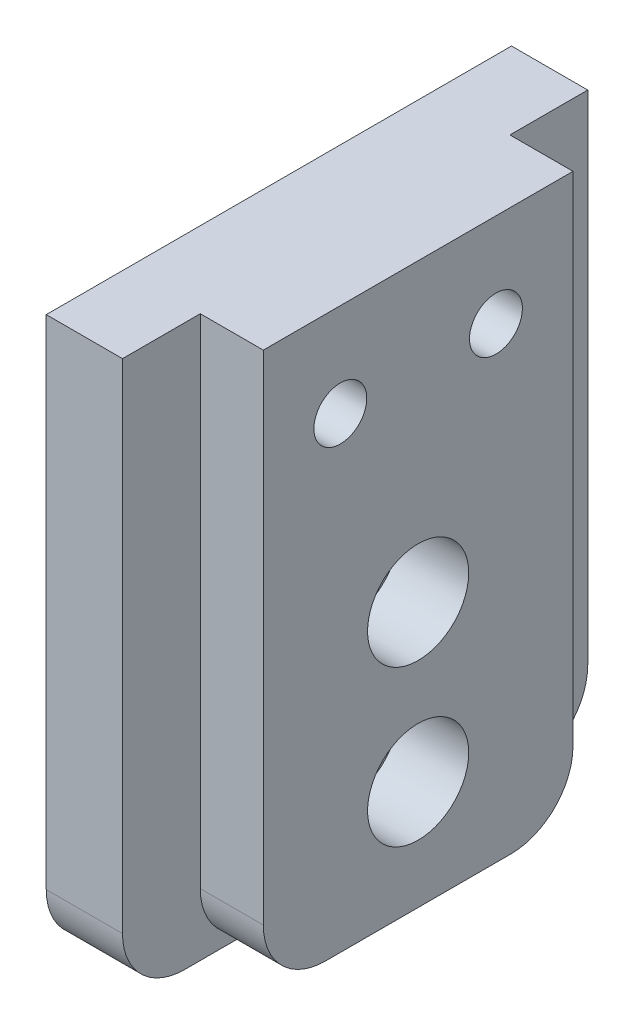
ISO-10303-21;
HEADER;
FILE_DESCRIPTION(('STEP AP214'),'2;1');
FILE_NAME('part.step','',(''),(''),'','','');
FILE_SCHEMA(('AUTOMOTIVE_DESIGN { 1 0 10303 214 1 1 1 1 }'));
ENDSEC;
DATA;
#1=APPLICATION_CONTEXT('core data for automotive mechanical design processes');
#2=APPLICATION_PROTOCOL_DEFINITION('international standard','automotive_design',2000,#1);
#3=PRODUCT_CONTEXT('',#1,'mechanical');
#4=PRODUCT('Part','Part','',(#3));
#5=PRODUCT_RELATED_PRODUCT_CATEGORY('part','',(#4));
#6=PRODUCT_DEFINITION_FORMATION('','',#4);
#7=PRODUCT_DEFINITION_CONTEXT('part definition',#1,'design');
#8=PRODUCT_DEFINITION('design','',#6,#7);
#9=PRODUCT_DEFINITION_SHAPE('','',#8);
#10=(LENGTH_UNIT() NAMED_UNIT(*) SI_UNIT(.MILLI.,.METRE.));
#11=(NAMED_UNIT(*) PLANE_ANGLE_UNIT() SI_UNIT($,.RADIAN.));
#12=(NAMED_UNIT(*) SI_UNIT($,.STERADIAN.) SOLID_ANGLE_UNIT());
#13=UNCERTAINTY_MEASURE_WITH_UNIT(LENGTH_MEASURE(1.E-05),#10,'distance_accuracy_value','');
#14=(GEOMETRIC_REPRESENTATION_CONTEXT(3) GLOBAL_UNCERTAINTY_ASSIGNED_CONTEXT((#13)) GLOBAL_UNIT_ASSIGNED_CONTEXT((#10,
#11,#12)) REPRESENTATION_CONTEXT('',''));
#15=CARTESIAN_POINT('',(0.,0.,0.));
#16=DIRECTION('',(0.,0.,1.));
#17=DIRECTION('',(1.,0.,0.));
#18=AXIS2_PLACEMENT_3D('',#15,#16,#17);
#19=CARTESIAN_POINT('',(0.,0.,0.));
#20=DIRECTION('',(1.,0.,0.));
#21=DIRECTION('',(0.,0.,-1.));
#22=AXIS2_PLACEMENT_3D('',#19,#20,#21);
#23=PLANE('',#22);
#24=DIRECTION('',(0.,1.,0.));
#25=VECTOR('',#24,1.);
#26=CARTESIAN_POINT('',(0.,-30.,-9.95));
#27=LINE('',#26,#25);
#28=CARTESIAN_POINT('',(0.,-26.,-9.95));
#29=VERTEX_POINT('',#28);
#30=CARTESIAN_POINT('',(0.,6.,-9.95));
#31=VERTEX_POINT('',#30);
#32=EDGE_CURVE('E138',#29,#31,#27,.T.);
#33=ORIENTED_EDGE('',*,*,#32,.T.);
#34=DIRECTION('',(0.,0.,1.));
#35=VECTOR('',#34,1.);
#36=CARTESIAN_POINT('',(0.,6.,10.));
#37=LINE('',#36,#35);
#38=CARTESIAN_POINT('',(0.,6.,9.95));
#39=VERTEX_POINT('',#38);
#40=EDGE_CURVE('E144',#31,#39,#37,.T.);
#41=ORIENTED_EDGE('',*,*,#40,.T.);
#42=DIRECTION('',(0.,1.,0.));
#43=VECTOR('',#42,1.);
#44=CARTESIAN_POINT('',(0.,-30.,9.95));
#45=LINE('',#44,#43);
#46=CARTESIAN_POINT('',(0.,-26.,9.95));
#47=VERTEX_POINT('',#46);
#48=EDGE_CURVE('E127',#47,#39,#45,.T.);
#49=ORIENTED_EDGE('',*,*,#48,.F.);
#50=CARTESIAN_POINT('',(0.,-26.,5.95));
#51=DIRECTION('',(1.,0.,0.));
#52=DIRECTION('',(0.,0.,-1.));
#53=AXIS2_PLACEMENT_3D('',#50,#51,#52);
#54=CIRCLE('',#53,4.);
#55=CARTESIAN_POINT('',(0.,-30.,5.95));
#56=VERTEX_POINT('',#55);
#57=EDGE_CURVE('E276',#47,#56,#54,.T.);
#58=ORIENTED_EDGE('',*,*,#57,.T.);
#59=DIRECTION('',(0.,0.,-1.));
#60=VECTOR('',#59,1.);
#61=CARTESIAN_POINT('',(0.,-30.,-10.));
#62=LINE('',#61,#60);
#63=CARTESIAN_POINT('',(0.,-30.,-5.95));
#64=VERTEX_POINT('',#63);
#65=EDGE_CURVE('E177',#56,#64,#62,.T.);
#66=ORIENTED_EDGE('',*,*,#65,.T.);
#67=CARTESIAN_POINT('',(0.,-26.,-5.95));
#68=DIRECTION('',(1.,0.,0.));
#69=DIRECTION('',(0.,0.,-1.));
#70=AXIS2_PLACEMENT_3D('',#67,#68,#69);
#71=CIRCLE('',#70,4.);
#72=EDGE_CURVE('E278',#64,#29,#71,.T.);
#73=ORIENTED_EDGE('',*,*,#72,.T.);
#74=EDGE_LOOP('',(#33,#41,#49,#58,#66,#73));
#75=FACE_BOUND('',#74,.T.);
#76=CARTESIAN_POINT('',(0.,0.,5.));
#77=DIRECTION('',(-1.,0.,0.));
#78=DIRECTION('',(0.,0.,1.));
#79=AXIS2_PLACEMENT_3D('',#76,#77,#78);
#80=CIRCLE('',#79,1.7);
#81=CARTESIAN_POINT('',(0.,0.,6.69999999999999));
#82=VERTEX_POINT('',#81);
#83=EDGE_CURVE('E154',#82,#82,#80,.T.);
#84=ORIENTED_EDGE('',*,*,#83,.T.);
#85=EDGE_LOOP('',(#84));
#86=FACE_BOUND('',#85,.T.);
#87=CARTESIAN_POINT('',(0.,0.,-5.));
#88=DIRECTION('',(-1.,0.,0.));
#89=DIRECTION('',(0.,0.,1.));
#90=AXIS2_PLACEMENT_3D('',#87,#88,#89);
#91=CIRCLE('',#90,1.7);
#92=CARTESIAN_POINT('',(0.,0.,-3.3));
#93=VERTEX_POINT('',#92);
#94=EDGE_CURVE('E43',#93,#93,#91,.T.);
#95=ORIENTED_EDGE('',*,*,#94,.T.);
#96=EDGE_LOOP('',(#95));
#97=FACE_BOUND('',#96,.T.);
#98=CARTESIAN_POINT('',(0.,-13.,0.));
#99=DIRECTION('',(1.,0.,0.));
#100=DIRECTION('',(0.,0.,-1.));
#101=AXIS2_PLACEMENT_3D('',#98,#99,#100);
#102=CIRCLE('',#101,3.25);
#103=CARTESIAN_POINT('',(0.,-13.,-3.25));
#104=VERTEX_POINT('',#103);
#105=EDGE_CURVE('E198',#104,#104,#102,.T.);
#106=ORIENTED_EDGE('',*,*,#105,.F.);
#107=EDGE_LOOP('',(#106));
#108=FACE_BOUND('',#107,.T.);
#109=CARTESIAN_POINT('',(0.,-23.,0.));
#110=DIRECTION('',(1.,0.,0.));
#111=DIRECTION('',(0.,0.,-1.));
#112=AXIS2_PLACEMENT_3D('',#109,#110,#111);
#113=CIRCLE('',#112,3.25);
#114=CARTESIAN_POINT('',(0.,-23.,-3.25));
#115=VERTEX_POINT('',#114);
#116=EDGE_CURVE('E188',#115,#115,#113,.T.);
#117=ORIENTED_EDGE('',*,*,#116,.F.);
#118=EDGE_LOOP('',(#117));
#119=FACE_BOUND('',#118,.T.);
#120=ADVANCED_FACE('F39',(#75,#86,#97,#108,#119),#23,.T.);
#121=CARTESIAN_POINT('',(0.,-23.,0.));
#122=DIRECTION('',(1.,0.,0.));
#123=DIRECTION('',(0.,0.,-1.));
#124=AXIS2_PLACEMENT_3D('',#121,#122,#123);
#125=CYLINDRICAL_SURFACE('',#124,1.7);
#126=CARTESIAN_POINT('',(-8.95,-23.,0.));
#127=DIRECTION('',(-1.,0.,0.));
#128=DIRECTION('',(0.,0.,1.));
#129=AXIS2_PLACEMENT_3D('',#126,#127,#128);
#130=CIRCLE('',#129,1.7);
#131=CARTESIAN_POINT('',(-8.95,-23.,1.7));
#132=VERTEX_POINT('',#131);
#133=EDGE_CURVE('E185',#132,#132,#130,.F.);
#134=ORIENTED_EDGE('',*,*,#133,.F.);
#135=EDGE_LOOP('',(#134));
#136=FACE_BOUND('',#135,.T.);
#137=CARTESIAN_POINT('',(-4.5,-23.,0.));
#138=DIRECTION('',(1.,0.,0.));
#139=DIRECTION('',(0.,0.,-1.));
#140=AXIS2_PLACEMENT_3D('',#137,#138,#139);
#141=CIRCLE('',#140,1.7);
#142=CARTESIAN_POINT('',(-4.5,-23.,-1.7));
#143=VERTEX_POINT('',#142);
#144=EDGE_CURVE('E181',#143,#143,#141,.T.);
#145=ORIENTED_EDGE('',*,*,#144,.T.);
#146=EDGE_LOOP('',(#145));
#147=FACE_BOUND('',#146,.T.);
#148=ADVANCED_FACE('F286',(#136,#147),#125,.F.);
#149=CARTESIAN_POINT('',(-4.5,-21.3,0.));
#150=DIRECTION('',(-1.,0.,0.));
#151=DIRECTION('',(0.,0.,1.));
#152=AXIS2_PLACEMENT_3D('',#149,#150,#151);
#153=PLANE('',#152);
#154=ORIENTED_EDGE('',*,*,#144,.F.);
#155=EDGE_LOOP('',(#154));
#156=FACE_BOUND('',#155,.T.);
#157=CARTESIAN_POINT('',(-4.5,-23.,0.));
#158=DIRECTION('',(1.,0.,0.));
#159=DIRECTION('',(0.,0.,-1.));
#160=AXIS2_PLACEMENT_3D('',#157,#158,#159);
#161=CIRCLE('',#160,3.25);
#162=CARTESIAN_POINT('',(-4.5,-23.,-3.25));
#163=VERTEX_POINT('',#162);
#164=EDGE_CURVE('E184',#163,#163,#161,.T.);
#165=ORIENTED_EDGE('',*,*,#164,.T.);
#166=EDGE_LOOP('',(#165));
#167=FACE_BOUND('',#166,.T.);
#168=ADVANCED_FACE('F289',(#156,#167),#153,.F.);
#169=CARTESIAN_POINT('',(0.,-23.,0.));
#170=DIRECTION('',(1.,0.,0.));
#171=DIRECTION('',(0.,0.,-1.));
#172=AXIS2_PLACEMENT_3D('',#169,#170,#171);
#173=CYLINDRICAL_SURFACE('',#172,3.25);
#174=ORIENTED_EDGE('',*,*,#164,.F.);
#175=EDGE_LOOP('',(#174));
#176=FACE_BOUND('',#175,.T.);
#177=ORIENTED_EDGE('',*,*,#116,.T.);
#178=EDGE_LOOP('',(#177));
#179=FACE_BOUND('',#178,.T.);
#180=ADVANCED_FACE('F295',(#176,#179),#173,.F.);
#181=CARTESIAN_POINT('',(0.,-13.,0.));
#182=DIRECTION('',(1.,0.,0.));
#183=DIRECTION('',(0.,0.,-1.));
#184=AXIS2_PLACEMENT_3D('',#181,#182,#183);
#185=CYLINDRICAL_SURFACE('',#184,1.7);
#186=CARTESIAN_POINT('',(-8.95,-13.,0.));
#187=DIRECTION('',(-1.,0.,0.));
#188=DIRECTION('',(0.,0.,1.));
#189=AXIS2_PLACEMENT_3D('',#186,#187,#188);
#190=CIRCLE('',#189,1.7);
#191=CARTESIAN_POINT('',(-8.95,-13.,1.7));
#192=VERTEX_POINT('',#191);
#193=EDGE_CURVE('E191',#192,#192,#190,.F.);
#194=ORIENTED_EDGE('',*,*,#193,.F.);
#195=EDGE_LOOP('',(#194));
#196=FACE_BOUND('',#195,.T.);
#197=CARTESIAN_POINT('',(-4.5,-13.,0.));
#198=DIRECTION('',(1.,0.,0.));
#199=DIRECTION('',(0.,0.,-1.));
#200=AXIS2_PLACEMENT_3D('',#197,#198,#199);
#201=CIRCLE('',#200,1.7);
#202=CARTESIAN_POINT('',(-4.5,-13.,-1.7));
#203=VERTEX_POINT('',#202);
#204=EDGE_CURVE('E192',#203,#203,#201,.T.);
#205=ORIENTED_EDGE('',*,*,#204,.T.);
#206=EDGE_LOOP('',(#205));
#207=FACE_BOUND('',#206,.T.);
#208=ADVANCED_FACE('F301',(#196,#207),#185,.F.);
#209=CARTESIAN_POINT('',(-4.5,-11.3,0.));
#210=DIRECTION('',(-1.,0.,0.));
#211=DIRECTION('',(0.,0.,1.));
#212=AXIS2_PLACEMENT_3D('',#209,#210,#211);
#213=PLANE('',#212);
#214=ORIENTED_EDGE('',*,*,#204,.F.);
#215=EDGE_LOOP('',(#214));
#216=FACE_BOUND('',#215,.T.);
#217=CARTESIAN_POINT('',(-4.5,-13.,0.));
#218=DIRECTION('',(1.,0.,0.));
#219=DIRECTION('',(0.,0.,-1.));
#220=AXIS2_PLACEMENT_3D('',#217,#218,#219);
#221=CIRCLE('',#220,3.25);
#222=CARTESIAN_POINT('',(-4.5,-13.,-3.25));
#223=VERTEX_POINT('',#222);
#224=EDGE_CURVE('E195',#223,#223,#221,.T.);
#225=ORIENTED_EDGE('',*,*,#224,.T.);
#226=EDGE_LOOP('',(#225));
#227=FACE_BOUND('',#226,.T.);
#228=ADVANCED_FACE('F344',(#216,#227),#213,.F.);
#229=CARTESIAN_POINT('',(0.,-13.,0.));
#230=DIRECTION('',(1.,0.,0.));
#231=DIRECTION('',(0.,0.,-1.));
#232=AXIS2_PLACEMENT_3D('',#229,#230,#231);
#233=CYLINDRICAL_SURFACE('',#232,3.25);
#234=ORIENTED_EDGE('',*,*,#224,.F.);
#235=EDGE_LOOP('',(#234));
#236=FACE_BOUND('',#235,.T.);
#237=ORIENTED_EDGE('',*,*,#105,.T.);
#238=EDGE_LOOP('',(#237));
#239=FACE_BOUND('',#238,.T.);
#240=ADVANCED_FACE('F348',(#236,#239),#233,.F.);
#241=CARTESIAN_POINT('',(-9.,0.,5.));
#242=DIRECTION('',(-1.,0.,0.));
#243=DIRECTION('',(0.,0.,1.));
#244=AXIS2_PLACEMENT_3D('',#241,#242,#243);
#245=CYLINDRICAL_SURFACE('',#244,3.25);
#246=CARTESIAN_POINT('',(-4.5,0.,5.));
#247=DIRECTION('',(-1.,0.,0.));
#248=DIRECTION('',(0.,0.,1.));
#249=AXIS2_PLACEMENT_3D('',#246,#247,#248);
#250=CIRCLE('',#249,3.25);
#251=CARTESIAN_POINT('',(-4.5,0.,8.25));
#252=VERTEX_POINT('',#251);
#253=EDGE_CURVE('E204',#252,#252,#250,.T.);
#254=ORIENTED_EDGE('',*,*,#253,.F.);
#255=EDGE_LOOP('',(#254));
#256=FACE_BOUND('',#255,.T.);
#257=CARTESIAN_POINT('',(-8.95,0.,5.));
#258=DIRECTION('',(-1.,0.,0.));
#259=DIRECTION('',(0.,0.,1.));
#260=AXIS2_PLACEMENT_3D('',#257,#258,#259);
#261=CIRCLE('',#260,3.25);
#262=CARTESIAN_POINT('',(-8.95,0.,8.25));
#263=VERTEX_POINT('',#262);
#264=EDGE_CURVE('E206',#263,#263,#261,.T.);
#265=ORIENTED_EDGE('',*,*,#264,.T.);
#266=EDGE_LOOP('',(#265));
#267=FACE_BOUND('',#266,.T.);
#268=ADVANCED_FACE('F352',(#256,#267),#245,.F.);
#269=CARTESIAN_POINT('',(-4.5,1.7,5.));
#270=DIRECTION('',(1.,0.,0.));
#271=DIRECTION('',(0.,0.,-1.));
#272=AXIS2_PLACEMENT_3D('',#269,#270,#271);
#273=PLANE('',#272);
#274=CARTESIAN_POINT('',(-4.5,0.,5.));
#275=DIRECTION('',(-1.,0.,0.));
#276=DIRECTION('',(0.,0.,1.));
#277=AXIS2_PLACEMENT_3D('',#274,#275,#276);
#278=CIRCLE('',#277,1.7);
#279=CARTESIAN_POINT('',(-4.5,0.,6.69999999999999));
#280=VERTEX_POINT('',#279);
#281=EDGE_CURVE('E201',#280,#280,#278,.T.);
#282=ORIENTED_EDGE('',*,*,#281,.F.);
#283=EDGE_LOOP('',(#282));
#284=FACE_BOUND('',#283,.T.);
#285=ORIENTED_EDGE('',*,*,#253,.T.);
#286=EDGE_LOOP('',(#285));
#287=FACE_BOUND('',#286,.T.);
#288=ADVANCED_FACE('F358',(#284,#287),#273,.F.);
#289=CARTESIAN_POINT('',(-9.,0.,5.));
#290=DIRECTION('',(-1.,0.,0.));
#291=DIRECTION('',(0.,0.,1.));
#292=AXIS2_PLACEMENT_3D('',#289,#290,#291);
#293=CYLINDRICAL_SURFACE('',#292,1.7);
#294=ORIENTED_EDGE('',*,*,#83,.F.);
#295=EDGE_LOOP('',(#294));
#296=FACE_BOUND('',#295,.T.);
#297=ORIENTED_EDGE('',*,*,#281,.T.);
#298=EDGE_LOOP('',(#297));
#299=FACE_BOUND('',#298,.T.);
#300=ADVANCED_FACE('F354',(#296,#299),#293,.F.);
#301=CARTESIAN_POINT('',(-9.,0.,-5.));
#302=DIRECTION('',(-1.,0.,0.));
#303=DIRECTION('',(0.,0.,1.));
#304=AXIS2_PLACEMENT_3D('',#301,#302,#303);
#305=CYLINDRICAL_SURFACE('',#304,3.25);
#306=CARTESIAN_POINT('',(-4.5,0.,-5.));
#307=DIRECTION('',(-1.,0.,0.));
#308=DIRECTION('',(0.,0.,1.));
#309=AXIS2_PLACEMENT_3D('',#306,#307,#308);
#310=CIRCLE('',#309,3.25);
#311=CARTESIAN_POINT('',(-4.5,0.,-1.75));
#312=VERTEX_POINT('',#311);
#313=EDGE_CURVE('E49',#312,#312,#310,.T.);
#314=ORIENTED_EDGE('',*,*,#313,.F.);
#315=EDGE_LOOP('',(#314));
#316=FACE_BOUND('',#315,.T.);
#317=CARTESIAN_POINT('',(-8.95,0.,-5.));
#318=DIRECTION('',(-1.,0.,0.));
#319=DIRECTION('',(0.,0.,1.));
#320=AXIS2_PLACEMENT_3D('',#317,#318,#319);
#321=CIRCLE('',#320,3.25);
#322=CARTESIAN_POINT('',(-8.95,0.,-1.75));
#323=VERTEX_POINT('',#322);
#324=EDGE_CURVE('E11',#323,#323,#321,.T.);
#325=ORIENTED_EDGE('',*,*,#324,.T.);
#326=EDGE_LOOP('',(#325));
#327=FACE_BOUND('',#326,.T.);
#328=ADVANCED_FACE('F357',(#316,#327),#305,.F.);
#329=CARTESIAN_POINT('',(-4.5,1.7,-5.));
#330=DIRECTION('',(1.,0.,0.));
#331=DIRECTION('',(0.,0.,-1.));
#332=AXIS2_PLACEMENT_3D('',#329,#330,#331);
#333=PLANE('',#332);
#334=CARTESIAN_POINT('',(-4.5,0.,-5.));
#335=DIRECTION('',(-1.,0.,0.));
#336=DIRECTION('',(0.,0.,1.));
#337=AXIS2_PLACEMENT_3D('',#334,#335,#336);
#338=CIRCLE('',#337,1.7);
#339=CARTESIAN_POINT('',(-4.5,0.,-3.3));
#340=VERTEX_POINT('',#339);
#341=EDGE_CURVE('E207',#340,#340,#338,.T.);
#342=ORIENTED_EDGE('',*,*,#341,.F.);
#343=EDGE_LOOP('',(#342));
#344=FACE_BOUND('',#343,.T.);
#345=ORIENTED_EDGE('',*,*,#313,.T.);
#346=EDGE_LOOP('',(#345));
#347=FACE_BOUND('',#346,.T.);
#348=ADVANCED_FACE('F368',(#344,#347),#333,.F.);
#349=CARTESIAN_POINT('',(-9.,0.,-5.));
#350=DIRECTION('',(-1.,0.,0.));
#351=DIRECTION('',(0.,0.,1.));
#352=AXIS2_PLACEMENT_3D('',#349,#350,#351);
#353=CYLINDRICAL_SURFACE('',#352,1.7);
#354=ORIENTED_EDGE('',*,*,#94,.F.);
#355=EDGE_LOOP('',(#354));
#356=FACE_BOUND('',#355,.T.);
#357=ORIENTED_EDGE('',*,*,#341,.T.);
#358=EDGE_LOOP('',(#357));
#359=FACE_BOUND('',#358,.T.);
#360=ADVANCED_FACE('F337',(#356,#359),#353,.F.);
#361=CARTESIAN_POINT('',(-9.,-30.,14.95));
#362=DIRECTION('',(0.,0.,1.));
#363=DIRECTION('',(1.,0.,0.));
#364=AXIS2_PLACEMENT_3D('',#361,#362,#363);
#365=PLANE('',#364);
#366=DIRECTION('',(0.,1.,0.));
#367=VECTOR('',#366,1.);
#368=CARTESIAN_POINT('',(-8.95,-30.,14.95));
#369=LINE('',#368,#367);
#370=CARTESIAN_POINT('',(-8.95,-26.,14.95));
#371=VERTEX_POINT('',#370);
#372=CARTESIAN_POINT('',(-8.95,6.,14.95));
#373=VERTEX_POINT('',#372);
#374=EDGE_CURVE('E175',#371,#373,#369,.T.);
#375=ORIENTED_EDGE('',*,*,#374,.F.);
#376=DIRECTION('',(1.,0.,0.));
#377=VECTOR('',#376,1.);
#378=CARTESIAN_POINT('',(-4.05,-26.,14.95));
#379=LINE('',#378,#377);
#380=CARTESIAN_POINT('',(-4.05,-26.,14.95));
#381=VERTEX_POINT('',#380);
#382=EDGE_CURVE('E256',#371,#381,#379,.T.);
#383=ORIENTED_EDGE('',*,*,#382,.T.);
#384=DIRECTION('',(0.,1.,0.));
#385=VECTOR('',#384,1.);
#386=CARTESIAN_POINT('',(-4.05,-30.,14.95));
#387=LINE('',#386,#385);
#388=CARTESIAN_POINT('',(-4.05,6.,14.95));
#389=VERTEX_POINT('',#388);
#390=EDGE_CURVE('E173',#381,#389,#387,.T.);
#391=ORIENTED_EDGE('',*,*,#390,.T.);
#392=DIRECTION('',(-1.,0.,0.));
#393=VECTOR('',#392,1.);
#394=CARTESIAN_POINT('',(0.,6.,14.95));
#395=LINE('',#394,#393);
#396=EDGE_CURVE('E227',#389,#373,#395,.T.);
#397=ORIENTED_EDGE('',*,*,#396,.T.);
#398=EDGE_LOOP('',(#375,#383,#391,#397));
#399=FACE_BOUND('',#398,.T.);
#400=ADVANCED_FACE('F255',(#399),#365,.T.);
#401=CARTESIAN_POINT('',(-4.,-30.,-14.95));
#402=DIRECTION('',(0.,0.,-1.));
#403=DIRECTION('',(-1.,0.,0.));
#404=AXIS2_PLACEMENT_3D('',#401,#402,#403);
#405=PLANE('',#404);
#406=DIRECTION('',(0.,1.,0.));
#407=VECTOR('',#406,1.);
#408=CARTESIAN_POINT('',(-4.05,-30.,-14.95));
#409=LINE('',#408,#407);
#410=CARTESIAN_POINT('',(-4.05,-26.,-14.95));
#411=VERTEX_POINT('',#410);
#412=CARTESIAN_POINT('',(-4.05,6.,-14.95));
#413=VERTEX_POINT('',#412);
#414=EDGE_CURVE('E58',#411,#413,#409,.T.);
#415=ORIENTED_EDGE('',*,*,#414,.F.);
#416=DIRECTION('',(-1.,0.,0.));
#417=VECTOR('',#416,1.);
#418=CARTESIAN_POINT('',(-8.95,-26.,-14.95));
#419=LINE('',#418,#417);
#420=CARTESIAN_POINT('',(-8.95,-26.,-14.95));
#421=VERTEX_POINT('',#420);
#422=EDGE_CURVE('E245',#411,#421,#419,.T.);
#423=ORIENTED_EDGE('',*,*,#422,.T.);
#424=DIRECTION('',(0.,1.,0.));
#425=VECTOR('',#424,1.);
#426=CARTESIAN_POINT('',(-8.95,-30.,-14.95));
#427=LINE('',#426,#425);
#428=CARTESIAN_POINT('',(-8.95,6.,-14.95));
#429=VERTEX_POINT('',#428);
#430=EDGE_CURVE('E238',#421,#429,#427,.T.);
#431=ORIENTED_EDGE('',*,*,#430,.T.);
#432=DIRECTION('',(1.,0.,0.));
#433=VECTOR('',#432,1.);
#434=CARTESIAN_POINT('',(0.,6.,-14.95));
#435=LINE('',#434,#433);
#436=EDGE_CURVE('E233',#429,#413,#435,.T.);
#437=ORIENTED_EDGE('',*,*,#436,.T.);
#438=EDGE_LOOP('',(#415,#423,#431,#437));
#439=FACE_BOUND('',#438,.T.);
#440=ADVANCED_FACE('F243',(#439),#405,.T.);
#441=CARTESIAN_POINT('',(0.,6.,10.));
#442=DIRECTION('',(0.,-1.,0.));
#443=DIRECTION('',(0.,0.,-1.));
#444=AXIS2_PLACEMENT_3D('',#441,#442,#443);
#445=PLANE('',#444);
#446=ORIENTED_EDGE('',*,*,#40,.F.);
#447=DIRECTION('',(-1.,0.,0.));
#448=VECTOR('',#447,1.);
#449=CARTESIAN_POINT('',(0.,6.,-9.95));
#450=LINE('',#449,#448);
#451=CARTESIAN_POINT('',(-4.05,6.,-9.95));
#452=VERTEX_POINT('',#451);
#453=EDGE_CURVE('E149',#31,#452,#450,.T.);
#454=ORIENTED_EDGE('',*,*,#453,.T.);
#455=DIRECTION('',(0.,0.,1.));
#456=VECTOR('',#455,1.);
#457=CARTESIAN_POINT('',(-4.05,6.,10.));
#458=LINE('',#457,#456);
#459=EDGE_CURVE('E222',#413,#452,#458,.T.);
#460=ORIENTED_EDGE('',*,*,#459,.F.);
#461=ORIENTED_EDGE('',*,*,#436,.F.);
#462=DIRECTION('',(0.,0.,-1.));
#463=VECTOR('',#462,1.);
#464=CARTESIAN_POINT('',(-8.95,6.,10.));
#465=LINE('',#464,#463);
#466=EDGE_CURVE('E230',#373,#429,#465,.T.);
#467=ORIENTED_EDGE('',*,*,#466,.F.);
#468=ORIENTED_EDGE('',*,*,#396,.F.);
#469=DIRECTION('',(0.,0.,1.));
#470=VECTOR('',#469,1.);
#471=CARTESIAN_POINT('',(-4.05,6.,10.));
#472=LINE('',#471,#470);
#473=CARTESIAN_POINT('',(-4.05,6.,9.95));
#474=VERTEX_POINT('',#473);
#475=EDGE_CURVE('E148',#474,#389,#472,.T.);
#476=ORIENTED_EDGE('',*,*,#475,.F.);
#477=DIRECTION('',(-1.,0.,0.));
#478=VECTOR('',#477,1.);
#479=CARTESIAN_POINT('',(0.,6.,9.95));
#480=LINE('',#479,#478);
#481=EDGE_CURVE('E131',#39,#474,#480,.T.);
#482=ORIENTED_EDGE('',*,*,#481,.F.);
#483=EDGE_LOOP('',(#446,#454,#460,#461,#467,#468,#476,#482));
#484=FACE_BOUND('',#483,.T.);
#485=ADVANCED_FACE('F143',(#484),#445,.F.);
#486=CARTESIAN_POINT('',(-4.,-26.,-10.95));
#487=DIRECTION('',(1.,0.,0.));
#488=DIRECTION('',(0.,0.,-1.));
#489=AXIS2_PLACEMENT_3D('',#486,#487,#488);
#490=CYLINDRICAL_SURFACE('',#489,4.);
#491=CARTESIAN_POINT('',(-4.05,-26.,-10.95));
#492=DIRECTION('',(1.,0.,0.));
#493=DIRECTION('',(0.,0.,-1.));
#494=AXIS2_PLACEMENT_3D('',#491,#492,#493);
#495=CIRCLE('',#494,4.);
#496=CARTESIAN_POINT('',(-4.05,-30.,-10.95));
#497=VERTEX_POINT('',#496);
#498=EDGE_CURVE('E649',#497,#411,#495,.T.);
#499=ORIENTED_EDGE('',*,*,#498,.F.);
#500=DIRECTION('',(-1.,0.,0.));
#501=VECTOR('',#500,1.);
#502=CARTESIAN_POINT('',(-4.05,-30.,-10.95));
#503=LINE('',#502,#501);
#504=CARTESIAN_POINT('',(-8.95,-30.,-10.95));
#505=VERTEX_POINT('',#504);
#506=EDGE_CURVE('E274',#505,#497,#503,.F.);
#507=ORIENTED_EDGE('',*,*,#506,.F.);
#508=CARTESIAN_POINT('',(-8.95,-26.,-10.95));
#509=DIRECTION('',(-1.,0.,0.));
#510=DIRECTION('',(0.,0.,1.));
#511=AXIS2_PLACEMENT_3D('',#508,#509,#510);
#512=CIRCLE('',#511,4.);
#513=EDGE_CURVE('E267',#421,#505,#512,.T.);
#514=ORIENTED_EDGE('',*,*,#513,.F.);
#515=ORIENTED_EDGE('',*,*,#422,.F.);
#516=EDGE_LOOP('',(#499,#507,#514,#515));
#517=FACE_BOUND('',#516,.T.);
#518=ADVANCED_FACE('F334',(#517),#490,.T.);
#519=CARTESIAN_POINT('',(-8.95,-30.,-15.));
#520=DIRECTION('',(-1.,0.,0.));
#521=DIRECTION('',(0.,0.,1.));
#522=AXIS2_PLACEMENT_3D('',#519,#520,#521);
#523=PLANE('',#522);
#524=ORIENTED_EDGE('',*,*,#324,.F.);
#525=EDGE_LOOP('',(#524));
#526=FACE_BOUND('',#525,.T.);
#527=ORIENTED_EDGE('',*,*,#264,.F.);
#528=EDGE_LOOP('',(#527));
#529=FACE_BOUND('',#528,.T.);
#530=ORIENTED_EDGE('',*,*,#193,.T.);
#531=EDGE_LOOP('',(#530));
#532=FACE_BOUND('',#531,.T.);
#533=ORIENTED_EDGE('',*,*,#133,.T.);
#534=EDGE_LOOP('',(#533));
#535=FACE_BOUND('',#534,.T.);
#536=DIRECTION('',(0.,0.,1.));
#537=VECTOR('',#536,1.);
#538=CARTESIAN_POINT('',(-8.95,-30.,0.));
#539=LINE('',#538,#537);
#540=CARTESIAN_POINT('',(-8.95,-30.,10.95));
#541=VERTEX_POINT('',#540);
#542=EDGE_CURVE('E223',#505,#541,#539,.T.);
#543=ORIENTED_EDGE('',*,*,#542,.T.);
#544=CARTESIAN_POINT('',(-8.95,-26.,10.95));
#545=DIRECTION('',(-1.,0.,0.));
#546=DIRECTION('',(0.,0.,1.));
#547=AXIS2_PLACEMENT_3D('',#544,#545,#546);
#548=CIRCLE('',#547,4.);
#549=EDGE_CURVE('E251',#541,#371,#548,.T.);
#550=ORIENTED_EDGE('',*,*,#549,.T.);
#551=ORIENTED_EDGE('',*,*,#374,.T.);
#552=ORIENTED_EDGE('',*,*,#466,.T.);
#553=ORIENTED_EDGE('',*,*,#430,.F.);
#554=ORIENTED_EDGE('',*,*,#513,.T.);
#555=EDGE_LOOP('',(#543,#550,#551,#552,#553,#554));
#556=FACE_BOUND('',#555,.T.);
#557=ADVANCED_FACE('F248',(#526,#529,#532,#535,#556),#523,.T.);
#558=CARTESIAN_POINT('',(-9.,-26.,10.95));
#559=DIRECTION('',(-1.,0.,0.));
#560=DIRECTION('',(0.,0.,1.));
#561=AXIS2_PLACEMENT_3D('',#558,#559,#560);
#562=CYLINDRICAL_SURFACE('',#561,4.);
#563=ORIENTED_EDGE('',*,*,#549,.F.);
#564=DIRECTION('',(1.,0.,0.));
#565=VECTOR('',#564,1.);
#566=CARTESIAN_POINT('',(-8.95,-30.,10.95));
#567=LINE('',#566,#565);
#568=CARTESIAN_POINT('',(-4.05,-30.,10.95));
#569=VERTEX_POINT('',#568);
#570=EDGE_CURVE('E265',#569,#541,#567,.F.);
#571=ORIENTED_EDGE('',*,*,#570,.F.);
#572=CARTESIAN_POINT('',(-4.05,-26.,10.95));
#573=DIRECTION('',(1.,0.,0.));
#574=DIRECTION('',(0.,0.,-1.));
#575=AXIS2_PLACEMENT_3D('',#572,#573,#574);
#576=CIRCLE('',#575,4.);
#577=EDGE_CURVE('E261',#381,#569,#576,.T.);
#578=ORIENTED_EDGE('',*,*,#577,.F.);
#579=ORIENTED_EDGE('',*,*,#382,.F.);
#580=EDGE_LOOP('',(#563,#571,#578,#579));
#581=FACE_BOUND('',#580,.T.);
#582=ADVANCED_FACE('F259',(#581),#562,.T.);
#583=CARTESIAN_POINT('',(0.,0.,9.95));
#584=DIRECTION('',(0.,0.,-1.));
#585=DIRECTION('',(-1.,0.,0.));
#586=AXIS2_PLACEMENT_3D('',#583,#584,#585);
#587=PLANE('',#586);
#588=ORIENTED_EDGE('',*,*,#48,.T.);
#589=ORIENTED_EDGE('',*,*,#481,.T.);
#590=DIRECTION('',(0.,1.,0.));
#591=VECTOR('',#590,1.);
#592=CARTESIAN_POINT('',(-4.05,-30.,9.95));
#593=LINE('',#592,#591);
#594=CARTESIAN_POINT('',(-4.05,-26.,9.95));
#595=VERTEX_POINT('',#594);
#596=EDGE_CURVE('E137',#595,#474,#593,.T.);
#597=ORIENTED_EDGE('',*,*,#596,.F.);
#598=DIRECTION('',(1.,0.,0.));
#599=VECTOR('',#598,1.);
#600=CARTESIAN_POINT('',(0.,-26.,9.95));
#601=LINE('',#600,#599);
#602=EDGE_CURVE('E134',#595,#47,#601,.T.);
#603=ORIENTED_EDGE('',*,*,#602,.T.);
#604=EDGE_LOOP('',(#588,#589,#597,#603));
#605=FACE_BOUND('',#604,.T.);
#606=ADVANCED_FACE('F129',(#605),#587,.F.);
#607=CARTESIAN_POINT('',(0.,0.,-9.95));
#608=DIRECTION('',(0.,0.,-1.));
#609=DIRECTION('',(-1.,0.,0.));
#610=AXIS2_PLACEMENT_3D('',#607,#608,#609);
#611=PLANE('',#610);
#612=ORIENTED_EDGE('',*,*,#453,.F.);
#613=ORIENTED_EDGE('',*,*,#32,.F.);
#614=DIRECTION('',(-1.,0.,0.));
#615=VECTOR('',#614,1.);
#616=CARTESIAN_POINT('',(-4.05,-26.,-9.95));
#617=LINE('',#616,#615);
#618=CARTESIAN_POINT('',(-4.05,-26.,-9.95));
#619=VERTEX_POINT('',#618);
#620=EDGE_CURVE('E280',#29,#619,#617,.T.);
#621=ORIENTED_EDGE('',*,*,#620,.T.);
#622=DIRECTION('',(0.,1.,0.));
#623=VECTOR('',#622,1.);
#624=CARTESIAN_POINT('',(-4.05,-30.,-9.95));
#625=LINE('',#624,#623);
#626=EDGE_CURVE('E163',#619,#452,#625,.T.);
#627=ORIENTED_EDGE('',*,*,#626,.T.);
#628=EDGE_LOOP('',(#612,#613,#621,#627));
#629=FACE_BOUND('',#628,.T.);
#630=ADVANCED_FACE('F41',(#629),#611,.T.);
#631=CARTESIAN_POINT('',(-4.05,-30.,-10.));
#632=DIRECTION('',(1.,0.,0.));
#633=DIRECTION('',(0.,0.,-1.));
#634=AXIS2_PLACEMENT_3D('',#631,#632,#633);
#635=PLANE('',#634);
#636=DIRECTION('',(0.,0.,-1.));
#637=VECTOR('',#636,1.);
#638=CARTESIAN_POINT('',(-4.05,-30.,0.));
#639=LINE('',#638,#637);
#640=CARTESIAN_POINT('',(-4.05,-30.,-5.95));
#641=VERTEX_POINT('',#640);
#642=EDGE_CURVE('E219',#641,#497,#639,.T.);
#643=ORIENTED_EDGE('',*,*,#642,.T.);
#644=ORIENTED_EDGE('',*,*,#498,.T.);
#645=ORIENTED_EDGE('',*,*,#414,.T.);
#646=ORIENTED_EDGE('',*,*,#459,.T.);
#647=ORIENTED_EDGE('',*,*,#626,.F.);
#648=CARTESIAN_POINT('',(-4.05,-26.,-5.95));
#649=DIRECTION('',(1.,0.,0.));
#650=DIRECTION('',(0.,0.,-1.));
#651=AXIS2_PLACEMENT_3D('',#648,#649,#650);
#652=CIRCLE('',#651,4.);
#653=EDGE_CURVE('E153',#619,#641,#652,.F.);
#654=ORIENTED_EDGE('',*,*,#653,.T.);
#655=EDGE_LOOP('',(#643,#644,#645,#646,#647,#654));
#656=FACE_BOUND('',#655,.T.);
#657=ADVANCED_FACE('F326',(#656),#635,.T.);
#658=CARTESIAN_POINT('',(0.,-30.,0.));
#659=DIRECTION('',(0.,1.,0.));
#660=DIRECTION('',(0.,0.,1.));
#661=AXIS2_PLACEMENT_3D('',#658,#659,#660);
#662=PLANE('',#661);
#663=ORIENTED_EDGE('',*,*,#65,.F.);
#664=DIRECTION('',(1.,0.,0.));
#665=VECTOR('',#664,1.);
#666=CARTESIAN_POINT('',(0.,-30.,5.95));
#667=LINE('',#666,#665);
#668=CARTESIAN_POINT('',(-4.05,-30.,5.95));
#669=VERTEX_POINT('',#668);
#670=EDGE_CURVE('E262',#56,#669,#667,.F.);
#671=ORIENTED_EDGE('',*,*,#670,.T.);
#672=DIRECTION('',(0.,0.,-1.));
#673=VECTOR('',#672,1.);
#674=CARTESIAN_POINT('',(-4.05,-30.,0.));
#675=LINE('',#674,#673);
#676=EDGE_CURVE('E180',#569,#669,#675,.T.);
#677=ORIENTED_EDGE('',*,*,#676,.F.);
#678=ORIENTED_EDGE('',*,*,#570,.T.);
#679=ORIENTED_EDGE('',*,*,#542,.F.);
#680=ORIENTED_EDGE('',*,*,#506,.T.);
#681=ORIENTED_EDGE('',*,*,#642,.F.);
#682=DIRECTION('',(-1.,0.,0.));
#683=VECTOR('',#682,1.);
#684=CARTESIAN_POINT('',(0.,-30.,-5.95));
#685=LINE('',#684,#683);
#686=EDGE_CURVE('E272',#641,#64,#685,.F.);
#687=ORIENTED_EDGE('',*,*,#686,.T.);
#688=EDGE_LOOP('',(#663,#671,#677,#678,#679,#680,#681,#687));
#689=FACE_BOUND('',#688,.T.);
#690=ADVANCED_FACE('F329',(#689),#662,.F.);
#691=CARTESIAN_POINT('',(0.,-26.,-5.95));
#692=DIRECTION('',(1.,0.,0.));
#693=DIRECTION('',(0.,0.,-1.));
#694=AXIS2_PLACEMENT_3D('',#691,#692,#693);
#695=CYLINDRICAL_SURFACE('',#694,4.);
#696=ORIENTED_EDGE('',*,*,#72,.F.);
#697=ORIENTED_EDGE('',*,*,#686,.F.);
#698=ORIENTED_EDGE('',*,*,#653,.F.);
#699=ORIENTED_EDGE('',*,*,#620,.F.);
#700=EDGE_LOOP('',(#696,#697,#698,#699));
#701=FACE_BOUND('',#700,.T.);
#702=ADVANCED_FACE('F319',(#701),#695,.T.);
#703=CARTESIAN_POINT('',(-4.05,-30.,15.));
#704=DIRECTION('',(1.,0.,0.));
#705=DIRECTION('',(0.,0.,-1.));
#706=AXIS2_PLACEMENT_3D('',#703,#704,#705);
#707=PLANE('',#706);
#708=ORIENTED_EDGE('',*,*,#390,.F.);
#709=ORIENTED_EDGE('',*,*,#577,.T.);
#710=ORIENTED_EDGE('',*,*,#676,.T.);
#711=CARTESIAN_POINT('',(-4.05,-26.,5.95));
#712=DIRECTION('',(1.,0.,0.));
#713=DIRECTION('',(0.,0.,-1.));
#714=AXIS2_PLACEMENT_3D('',#711,#712,#713);
#715=CIRCLE('',#714,4.);
#716=EDGE_CURVE('E157',#669,#595,#715,.F.);
#717=ORIENTED_EDGE('',*,*,#716,.T.);
#718=ORIENTED_EDGE('',*,*,#596,.T.);
#719=ORIENTED_EDGE('',*,*,#475,.T.);
#720=EDGE_LOOP('',(#708,#709,#710,#717,#718,#719));
#721=FACE_BOUND('',#720,.T.);
#722=ADVANCED_FACE('F313',(#721),#707,.T.);
#723=CARTESIAN_POINT('',(0.,-26.,5.95));
#724=DIRECTION('',(1.,0.,0.));
#725=DIRECTION('',(0.,0.,-1.));
#726=AXIS2_PLACEMENT_3D('',#723,#724,#725);
#727=CYLINDRICAL_SURFACE('',#726,4.);
#728=ORIENTED_EDGE('',*,*,#716,.F.);
#729=ORIENTED_EDGE('',*,*,#670,.F.);
#730=ORIENTED_EDGE('',*,*,#57,.F.);
#731=ORIENTED_EDGE('',*,*,#602,.F.);
#732=EDGE_LOOP('',(#728,#729,#730,#731));
#733=FACE_BOUND('',#732,.T.);
#734=ADVANCED_FACE('F307',(#733),#727,.T.);
#735=CLOSED_SHELL('',(#120,#148,#168,#180,#208,#228,#240,#268,#288,#300,#328,#348,#360,#400,
#440,#485,#518,#557,#582,#606,#630,#657,#690,#702,#722,#734));
#736=MANIFOLD_SOLID_BREP('B2',#735);
#737=ADVANCED_BREP_SHAPE_REPRESENTATION('',(#18,#736),#14);
#738=SHAPE_DEFINITION_REPRESENTATION(#9,#737);
ENDSEC;
END-ISO-10303-21;
